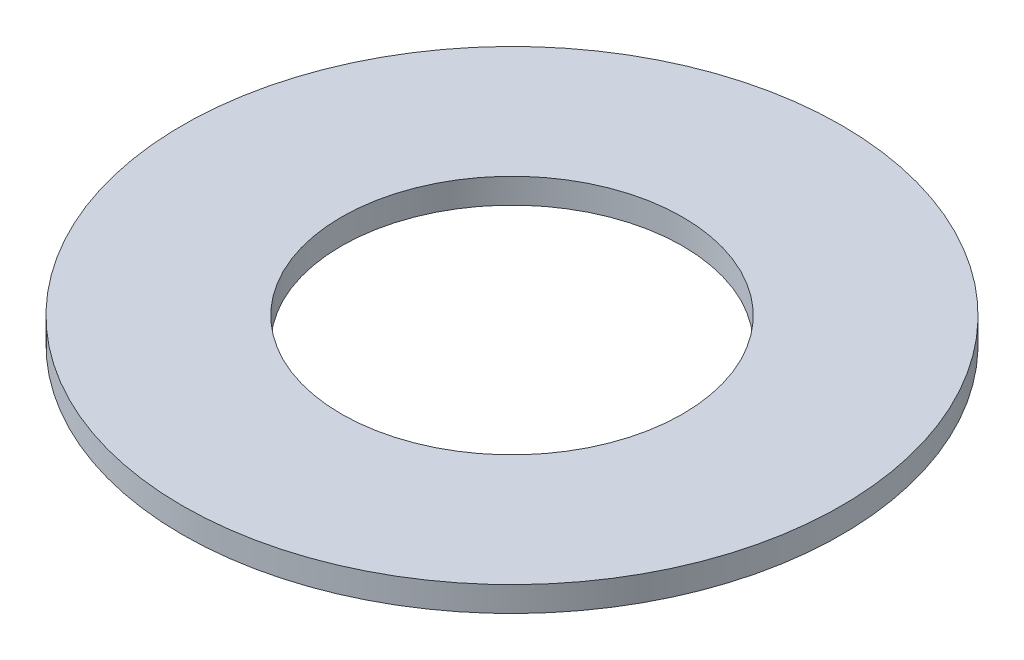
ISO-10303-21;
HEADER;
FILE_DESCRIPTION(('STEP AP214'),'2;1');
FILE_NAME('part.step','',(''),(''),'','','');
FILE_SCHEMA(('AUTOMOTIVE_DESIGN { 1 0 10303 214 1 1 1 1 }'));
ENDSEC;
DATA;
#1=APPLICATION_CONTEXT('core data for automotive mechanical design processes');
#2=APPLICATION_PROTOCOL_DEFINITION('international standard','automotive_design',2000,#1);
#3=PRODUCT_CONTEXT('',#1,'mechanical');
#4=PRODUCT('Part','Part','',(#3));
#5=PRODUCT_RELATED_PRODUCT_CATEGORY('part','',(#4));
#6=PRODUCT_DEFINITION_FORMATION('','',#4);
#7=PRODUCT_DEFINITION_CONTEXT('part definition',#1,'design');
#8=PRODUCT_DEFINITION('design','',#6,#7);
#9=PRODUCT_DEFINITION_SHAPE('','',#8);
#10=(LENGTH_UNIT() NAMED_UNIT(*) SI_UNIT(.MILLI.,.METRE.));
#11=(NAMED_UNIT(*) PLANE_ANGLE_UNIT() SI_UNIT($,.RADIAN.));
#12=(NAMED_UNIT(*) SI_UNIT($,.STERADIAN.) SOLID_ANGLE_UNIT());
#13=UNCERTAINTY_MEASURE_WITH_UNIT(LENGTH_MEASURE(1.E-05),#10,'distance_accuracy_value','');
#14=(GEOMETRIC_REPRESENTATION_CONTEXT(3) GLOBAL_UNCERTAINTY_ASSIGNED_CONTEXT((#13)) GLOBAL_UNIT_ASSIGNED_CONTEXT((#10,
#11,#12)) REPRESENTATION_CONTEXT('',''));
#15=CARTESIAN_POINT('',(0.,0.,0.));
#16=DIRECTION('',(0.,0.,1.));
#17=DIRECTION('',(1.,0.,0.));
#18=AXIS2_PLACEMENT_3D('',#15,#16,#17);
#19=CARTESIAN_POINT('',(0.,3.3782,0.));
#20=DIRECTION('',(0.,-1.,0.));
#21=DIRECTION('',(0.,0.,-1.));
#22=AXIS2_PLACEMENT_3D('',#19,#20,#21);
#23=CYLINDRICAL_SURFACE('',#22,44.45);
#24=CARTESIAN_POINT('',(0.,3.3782,0.));
#25=DIRECTION('',(0.,1.,0.));
#26=DIRECTION('',(0.,0.,1.));
#27=AXIS2_PLACEMENT_3D('',#24,#25,#26);
#28=CIRCLE('',#27,44.45);
#29=CARTESIAN_POINT('',(0.,3.3782,44.45));
#30=VERTEX_POINT('',#29);
#31=EDGE_CURVE('E10',#30,#30,#28,.T.);
#32=ORIENTED_EDGE('',*,*,#31,.F.);
#33=EDGE_LOOP('',(#32));
#34=FACE_BOUND('',#33,.T.);
#35=CARTESIAN_POINT('',(0.,0.,0.));
#36=DIRECTION('',(0.,1.,0.));
#37=DIRECTION('',(0.,0.,1.));
#38=AXIS2_PLACEMENT_3D('',#35,#36,#37);
#39=CIRCLE('',#38,44.45);
#40=CARTESIAN_POINT('',(0.,0.,44.45));
#41=VERTEX_POINT('',#40);
#42=EDGE_CURVE('E38',#41,#41,#39,.T.);
#43=ORIENTED_EDGE('',*,*,#42,.T.);
#44=EDGE_LOOP('',(#43));
#45=FACE_BOUND('',#44,.T.);
#46=ADVANCED_FACE('F35',(#34,#45),#23,.T.);
#47=CARTESIAN_POINT('',(0.,3.3782,0.));
#48=DIRECTION('',(0.,1.,0.));
#49=DIRECTION('',(0.,0.,1.));
#50=AXIS2_PLACEMENT_3D('',#47,#48,#49);
#51=PLANE('',#50);
#52=CARTESIAN_POINT('',(0.,3.3782,0.));
#53=DIRECTION('',(0.,1.,0.));
#54=DIRECTION('',(0.,0.,1.));
#55=AXIS2_PLACEMENT_3D('',#52,#53,#54);
#56=CIRCLE('',#55,23.0124);
#57=CARTESIAN_POINT('',(0.,3.3782,23.0124));
#58=VERTEX_POINT('',#57);
#59=EDGE_CURVE('E47',#58,#58,#56,.T.);
#60=ORIENTED_EDGE('',*,*,#59,.F.);
#61=EDGE_LOOP('',(#60));
#62=FACE_BOUND('',#61,.T.);
#63=ORIENTED_EDGE('',*,*,#31,.T.);
#64=EDGE_LOOP('',(#63));
#65=FACE_BOUND('',#64,.T.);
#66=ADVANCED_FACE('F62',(#62,#65),#51,.T.);
#67=CARTESIAN_POINT('',(0.,0.,0.));
#68=DIRECTION('',(0.,1.,0.));
#69=DIRECTION('',(0.,0.,1.));
#70=AXIS2_PLACEMENT_3D('',#67,#68,#69);
#71=PLANE('',#70);
#72=CARTESIAN_POINT('',(0.,0.,0.));
#73=DIRECTION('',(0.,1.,0.));
#74=DIRECTION('',(0.,0.,1.));
#75=AXIS2_PLACEMENT_3D('',#72,#73,#74);
#76=CIRCLE('',#75,23.0124);
#77=CARTESIAN_POINT('',(0.,0.,23.0124));
#78=VERTEX_POINT('',#77);
#79=EDGE_CURVE('E45',#78,#78,#76,.T.);
#80=ORIENTED_EDGE('',*,*,#79,.T.);
#81=EDGE_LOOP('',(#80));
#82=FACE_BOUND('',#81,.T.);
#83=ORIENTED_EDGE('',*,*,#42,.F.);
#84=EDGE_LOOP('',(#83));
#85=FACE_BOUND('',#84,.T.);
#86=ADVANCED_FACE('F53',(#82,#85),#71,.F.);
#87=CARTESIAN_POINT('',(0.,0.,0.));
#88=DIRECTION('',(0.,1.,0.));
#89=DIRECTION('',(0.,0.,1.));
#90=AXIS2_PLACEMENT_3D('',#87,#88,#89);
#91=CYLINDRICAL_SURFACE('',#90,23.0124);
#92=ORIENTED_EDGE('',*,*,#79,.F.);
#93=EDGE_LOOP('',(#92));
#94=FACE_BOUND('',#93,.T.);
#95=ORIENTED_EDGE('',*,*,#59,.T.);
#96=EDGE_LOOP('',(#95));
#97=FACE_BOUND('',#96,.T.);
#98=ADVANCED_FACE('F56',(#94,#97),#91,.F.);
#99=CLOSED_SHELL('',(#46,#66,#86,#98));
#100=MANIFOLD_SOLID_BREP('B2',#99);
#101=ADVANCED_BREP_SHAPE_REPRESENTATION('',(#18,#100),#14);
#102=SHAPE_DEFINITION_REPRESENTATION(#9,#101);
ENDSEC;
END-ISO-10303-21;
